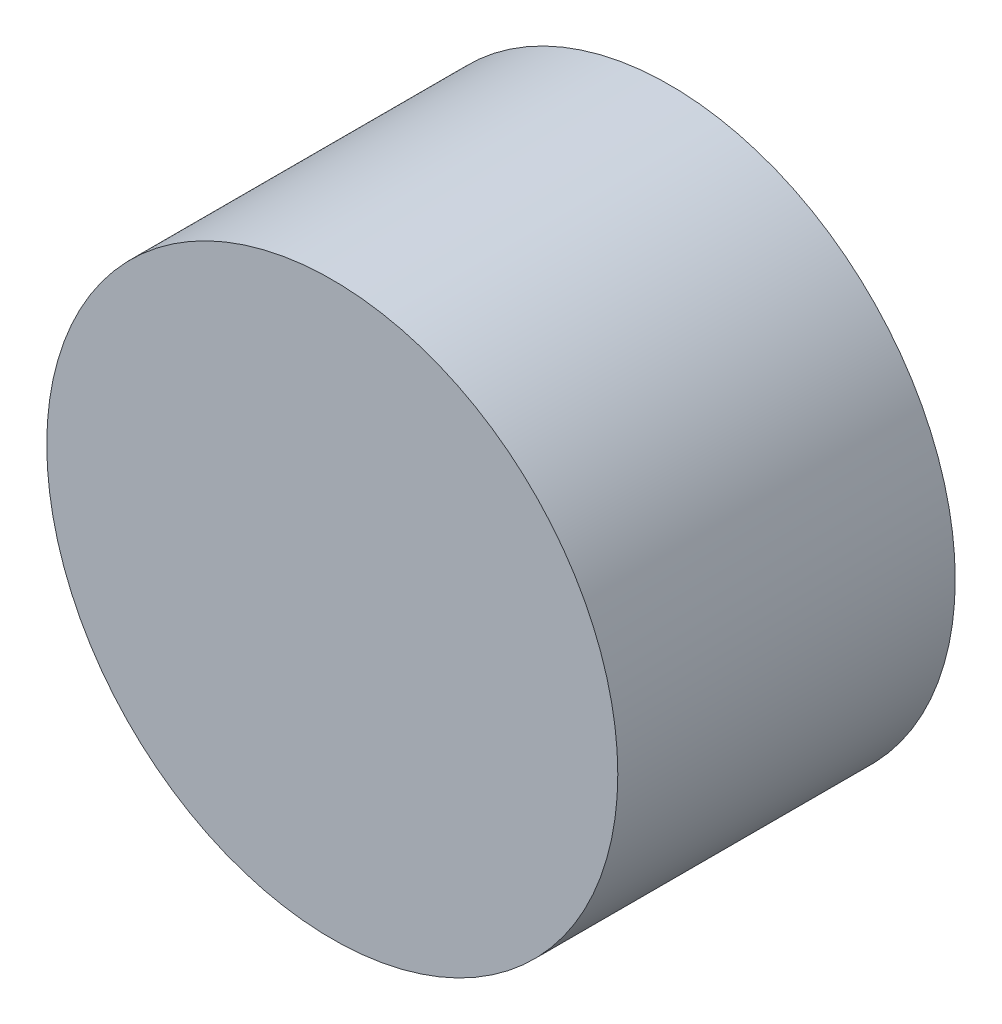
ISO-10303-21;
HEADER;
FILE_DESCRIPTION(('STEP AP214'),'2;1');
FILE_NAME('part.step','',(''),(''),'','','');
FILE_SCHEMA(('AUTOMOTIVE_DESIGN { 1 0 10303 214 1 1 1 1 }'));
ENDSEC;
DATA;
#1=APPLICATION_CONTEXT('core data for automotive mechanical design processes');
#2=APPLICATION_PROTOCOL_DEFINITION('international standard','automotive_design',2000,#1);
#3=PRODUCT_CONTEXT('',#1,'mechanical');
#4=PRODUCT('Part','Part','',(#3));
#5=PRODUCT_RELATED_PRODUCT_CATEGORY('part','',(#4));
#6=PRODUCT_DEFINITION_FORMATION('','',#4);
#7=PRODUCT_DEFINITION_CONTEXT('part definition',#1,'design');
#8=PRODUCT_DEFINITION('design','',#6,#7);
#9=PRODUCT_DEFINITION_SHAPE('','',#8);
#10=(LENGTH_UNIT() NAMED_UNIT(*) SI_UNIT(.MILLI.,.METRE.));
#11=(NAMED_UNIT(*) PLANE_ANGLE_UNIT() SI_UNIT($,.RADIAN.));
#12=(NAMED_UNIT(*) SI_UNIT($,.STERADIAN.) SOLID_ANGLE_UNIT());
#13=UNCERTAINTY_MEASURE_WITH_UNIT(LENGTH_MEASURE(1.E-05),#10,'distance_accuracy_value','');
#14=(GEOMETRIC_REPRESENTATION_CONTEXT(3) GLOBAL_UNCERTAINTY_ASSIGNED_CONTEXT((#13)) GLOBAL_UNIT_ASSIGNED_CONTEXT((#10,
#11,#12)) REPRESENTATION_CONTEXT('',''));
#15=CARTESIAN_POINT('',(0.,0.,0.));
#16=DIRECTION('',(0.,0.,1.));
#17=DIRECTION('',(1.,0.,0.));
#18=AXIS2_PLACEMENT_3D('',#15,#16,#17);
#19=CARTESIAN_POINT('',(0.,0.,3.25));
#20=DIRECTION('',(0.,0.,-1.));
#21=DIRECTION('',(-1.,0.,0.));
#22=AXIS2_PLACEMENT_3D('',#19,#20,#21);
#23=CYLINDRICAL_SURFACE('',#22,2.75);
#24=CARTESIAN_POINT('',(0.,0.,3.25));
#25=DIRECTION('',(0.,0.,1.));
#26=DIRECTION('',(1.,0.,0.));
#27=AXIS2_PLACEMENT_3D('',#24,#25,#26);
#28=CIRCLE('',#27,2.75);
#29=CARTESIAN_POINT('',(2.75,0.,3.25));
#30=VERTEX_POINT('',#29);
#31=EDGE_CURVE('E10',#30,#30,#28,.T.);
#32=ORIENTED_EDGE('',*,*,#31,.F.);
#33=EDGE_LOOP('',(#32));
#34=FACE_BOUND('',#33,.T.);
#35=CARTESIAN_POINT('',(0.,0.,0.));
#36=DIRECTION('',(0.,0.,1.));
#37=DIRECTION('',(1.,0.,0.));
#38=AXIS2_PLACEMENT_3D('',#35,#36,#37);
#39=CIRCLE('',#38,2.75);
#40=CARTESIAN_POINT('',(2.75,0.,0.));
#41=VERTEX_POINT('',#40);
#42=EDGE_CURVE('E42',#41,#41,#39,.T.);
#43=ORIENTED_EDGE('',*,*,#42,.T.);
#44=EDGE_LOOP('',(#43));
#45=FACE_BOUND('',#44,.T.);
#46=ADVANCED_FACE('F39',(#34,#45),#23,.T.);
#47=CARTESIAN_POINT('',(0.,0.,3.25));
#48=DIRECTION('',(0.,0.,1.));
#49=DIRECTION('',(1.,0.,0.));
#50=AXIS2_PLACEMENT_3D('',#47,#48,#49);
#51=PLANE('',#50);
#52=ORIENTED_EDGE('',*,*,#31,.T.);
#53=EDGE_LOOP('',(#52));
#54=FACE_BOUND('',#53,.T.);
#55=ADVANCED_FACE('F54',(#54),#51,.T.);
#56=CARTESIAN_POINT('',(0.,0.,0.));
#57=DIRECTION('',(0.,0.,1.));
#58=DIRECTION('',(1.,0.,0.));
#59=AXIS2_PLACEMENT_3D('',#56,#57,#58);
#60=PLANE('',#59);
#61=ORIENTED_EDGE('',*,*,#42,.F.);
#62=EDGE_LOOP('',(#61));
#63=FACE_BOUND('',#62,.T.);
#64=ADVANCED_FACE('F52',(#63),#60,.F.);
#65=CLOSED_SHELL('',(#46,#55,#64));
#66=MANIFOLD_SOLID_BREP('B2',#65);
#67=ADVANCED_BREP_SHAPE_REPRESENTATION('',(#18,#66),#14);
#68=SHAPE_DEFINITION_REPRESENTATION(#9,#67);
ENDSEC;
END-ISO-10303-21;
